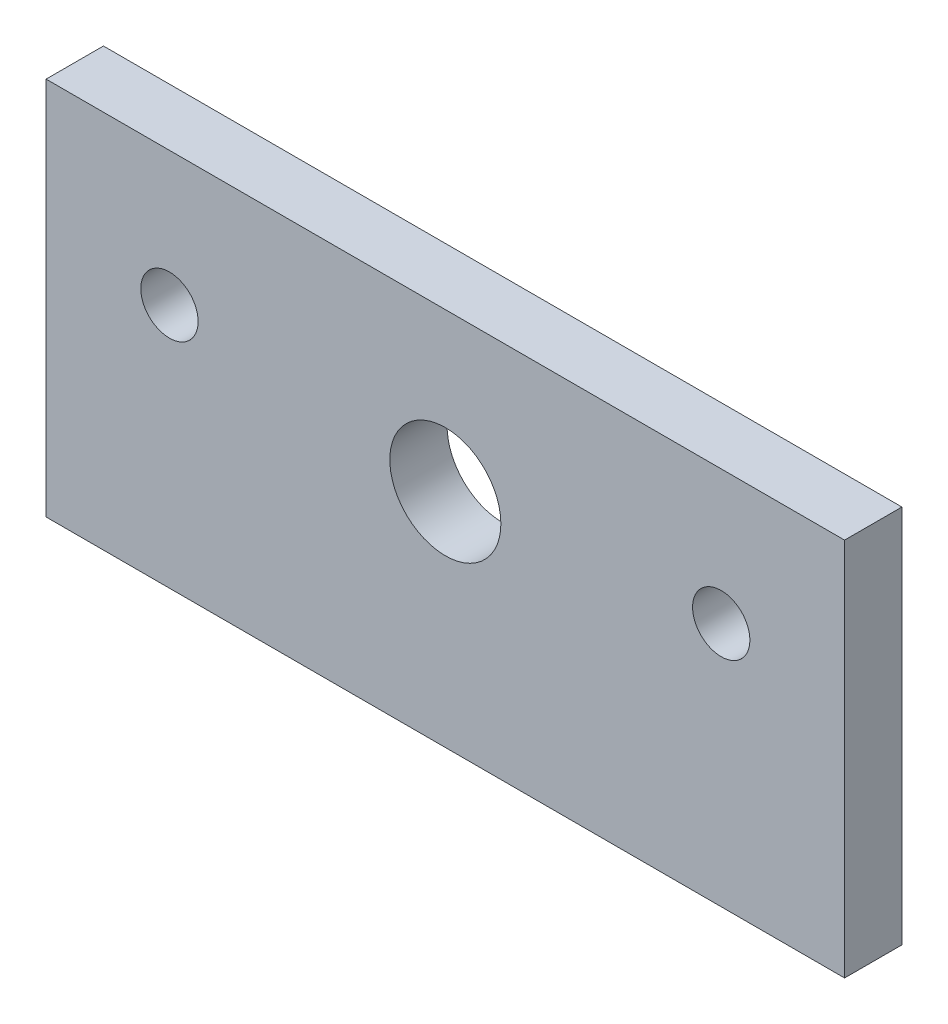
ISO-10303-21;
HEADER;
FILE_DESCRIPTION(('STEP AP214'),'2;1');
FILE_NAME('part.step','',(''),(''),'','','');
FILE_SCHEMA(('AUTOMOTIVE_DESIGN { 1 0 10303 214 1 1 1 1 }'));
ENDSEC;
DATA;
#1=APPLICATION_CONTEXT('core data for automotive mechanical design processes');
#2=APPLICATION_PROTOCOL_DEFINITION('international standard','automotive_design',2000,#1);
#3=PRODUCT_CONTEXT('',#1,'mechanical');
#4=PRODUCT('Part','Part','',(#3));
#5=PRODUCT_RELATED_PRODUCT_CATEGORY('part','',(#4));
#6=PRODUCT_DEFINITION_FORMATION('','',#4);
#7=PRODUCT_DEFINITION_CONTEXT('part definition',#1,'design');
#8=PRODUCT_DEFINITION('design','',#6,#7);
#9=PRODUCT_DEFINITION_SHAPE('','',#8);
#10=(LENGTH_UNIT() NAMED_UNIT(*) SI_UNIT(.MILLI.,.METRE.));
#11=(NAMED_UNIT(*) PLANE_ANGLE_UNIT() SI_UNIT($,.RADIAN.));
#12=(NAMED_UNIT(*) SI_UNIT($,.STERADIAN.) SOLID_ANGLE_UNIT());
#13=UNCERTAINTY_MEASURE_WITH_UNIT(LENGTH_MEASURE(1.E-05),#10,'distance_accuracy_value','');
#14=(GEOMETRIC_REPRESENTATION_CONTEXT(3) GLOBAL_UNCERTAINTY_ASSIGNED_CONTEXT((#13)) GLOBAL_UNIT_ASSIGNED_CONTEXT((#10,
#11,#12)) REPRESENTATION_CONTEXT('',''));
#15=CARTESIAN_POINT('',(0.,0.,0.));
#16=DIRECTION('',(0.,0.,1.));
#17=DIRECTION('',(1.,0.,0.));
#18=AXIS2_PLACEMENT_3D('',#15,#16,#17);
#19=CARTESIAN_POINT('',(-55.9295902988013,0.,8.));
#20=DIRECTION('',(-1.,0.,0.));
#21=DIRECTION('',(0.,0.,1.));
#22=AXIS2_PLACEMENT_3D('',#19,#20,#21);
#23=PLANE('',#22);
#24=DIRECTION('',(0.,1.,0.));
#25=VECTOR('',#24,1.);
#26=CARTESIAN_POINT('',(-55.9295902988013,0.,0.));
#27=LINE('',#26,#25);
#28=CARTESIAN_POINT('',(-55.9295902988013,-41.6378703415326,0.));
#29=VERTEX_POINT('',#28);
#30=CARTESIAN_POINT('',(-55.9295902988013,11.283196531097,0.));
#31=VERTEX_POINT('',#30);
#32=EDGE_CURVE('E131',#29,#31,#27,.T.);
#33=ORIENTED_EDGE('',*,*,#32,.F.);
#34=DIRECTION('',(0.,0.,-1.));
#35=VECTOR('',#34,1.);
#36=CARTESIAN_POINT('',(-55.9295902988013,-41.6378703415326,8.));
#37=LINE('',#36,#35);
#38=CARTESIAN_POINT('',(-55.9295902988013,-41.6378703415326,8.));
#39=VERTEX_POINT('',#38);
#40=EDGE_CURVE('E11',#39,#29,#37,.T.);
#41=ORIENTED_EDGE('',*,*,#40,.F.);
#42=DIRECTION('',(0.,1.,0.));
#43=VECTOR('',#42,1.);
#44=CARTESIAN_POINT('',(-55.9295902988013,0.,8.));
#45=LINE('',#44,#43);
#46=CARTESIAN_POINT('',(-55.9295902988013,11.283196531097,8.));
#47=VERTEX_POINT('',#46);
#48=EDGE_CURVE('E109',#39,#47,#45,.T.);
#49=ORIENTED_EDGE('',*,*,#48,.T.);
#50=DIRECTION('',(0.,0.,-1.));
#51=VECTOR('',#50,1.);
#52=CARTESIAN_POINT('',(-55.9295902988013,11.283196531097,8.));
#53=LINE('',#52,#51);
#54=EDGE_CURVE('E69',#47,#31,#53,.T.);
#55=ORIENTED_EDGE('',*,*,#54,.T.);
#56=EDGE_LOOP('',(#33,#41,#49,#55));
#57=FACE_BOUND('',#56,.T.);
#58=ADVANCED_FACE('F51',(#57),#23,.T.);
#59=CARTESIAN_POINT('',(0.,-41.6378703415326,8.));
#60=DIRECTION('',(0.,-1.,0.));
#61=DIRECTION('',(0.,0.,-1.));
#62=AXIS2_PLACEMENT_3D('',#59,#60,#61);
#63=PLANE('',#62);
#64=DIRECTION('',(-1.,0.,0.));
#65=VECTOR('',#64,1.);
#66=CARTESIAN_POINT('',(0.,-41.6378703415326,0.));
#67=LINE('',#66,#65);
#68=CARTESIAN_POINT('',(55.4962481395173,-41.6378703415326,0.));
#69=VERTEX_POINT('',#68);
#70=EDGE_CURVE('E99',#69,#29,#67,.T.);
#71=ORIENTED_EDGE('',*,*,#70,.F.);
#72=DIRECTION('',(0.,0.,-1.));
#73=VECTOR('',#72,1.);
#74=CARTESIAN_POINT('',(55.4962481395173,-41.6378703415326,8.));
#75=LINE('',#74,#73);
#76=CARTESIAN_POINT('',(55.4962481395173,-41.6378703415326,8.));
#77=VERTEX_POINT('',#76);
#78=EDGE_CURVE('E61',#77,#69,#75,.T.);
#79=ORIENTED_EDGE('',*,*,#78,.F.);
#80=DIRECTION('',(-1.,0.,0.));
#81=VECTOR('',#80,1.);
#82=CARTESIAN_POINT('',(0.,-41.6378703415326,8.));
#83=LINE('',#82,#81);
#84=EDGE_CURVE('E97',#77,#39,#83,.T.);
#85=ORIENTED_EDGE('',*,*,#84,.T.);
#86=ORIENTED_EDGE('',*,*,#40,.T.);
#87=EDGE_LOOP('',(#71,#79,#85,#86));
#88=FACE_BOUND('',#87,.T.);
#89=ADVANCED_FACE('F96',(#88),#63,.T.);
#90=CARTESIAN_POINT('',(55.4962481395173,0.,8.));
#91=DIRECTION('',(1.,0.,0.));
#92=DIRECTION('',(0.,0.,-1.));
#93=AXIS2_PLACEMENT_3D('',#90,#91,#92);
#94=PLANE('',#93);
#95=DIRECTION('',(0.,-1.,0.));
#96=VECTOR('',#95,1.);
#97=CARTESIAN_POINT('',(55.4962481395173,0.,0.));
#98=LINE('',#97,#96);
#99=CARTESIAN_POINT('',(55.4962481395173,11.283196531097,0.));
#100=VERTEX_POINT('',#99);
#101=EDGE_CURVE('E136',#100,#69,#98,.T.);
#102=ORIENTED_EDGE('',*,*,#101,.F.);
#103=DIRECTION('',(0.,0.,-1.));
#104=VECTOR('',#103,1.);
#105=CARTESIAN_POINT('',(55.4962481395173,11.283196531097,8.));
#106=LINE('',#105,#104);
#107=CARTESIAN_POINT('',(55.4962481395173,11.283196531097,8.));
#108=VERTEX_POINT('',#107);
#109=EDGE_CURVE('E82',#108,#100,#106,.T.);
#110=ORIENTED_EDGE('',*,*,#109,.F.);
#111=DIRECTION('',(0.,-1.,0.));
#112=VECTOR('',#111,1.);
#113=CARTESIAN_POINT('',(55.4962481395173,0.,8.));
#114=LINE('',#113,#112);
#115=EDGE_CURVE('E108',#108,#77,#114,.T.);
#116=ORIENTED_EDGE('',*,*,#115,.T.);
#117=ORIENTED_EDGE('',*,*,#78,.T.);
#118=EDGE_LOOP('',(#102,#110,#116,#117));
#119=FACE_BOUND('',#118,.T.);
#120=ADVANCED_FACE('F112',(#119),#94,.T.);
#121=CARTESIAN_POINT('',(38.2833289203579,-7.41680346890308,8.));
#122=DIRECTION('',(0.,0.,-1.));
#123=DIRECTION('',(-1.,0.,0.));
#124=AXIS2_PLACEMENT_3D('',#121,#122,#123);
#125=CYLINDRICAL_SURFACE('',#124,4.00000000000001);
#126=CARTESIAN_POINT('',(38.2833289203579,-7.41680346890308,8.));
#127=DIRECTION('',(0.,0.,1.));
#128=DIRECTION('',(1.,0.,0.));
#129=AXIS2_PLACEMENT_3D('',#126,#127,#128);
#130=CIRCLE('',#129,4.00000000000001);
#131=CARTESIAN_POINT('',(42.283328920358,-7.41680346890308,8.));
#132=VERTEX_POINT('',#131);
#133=EDGE_CURVE('E160',#132,#132,#130,.T.);
#134=ORIENTED_EDGE('',*,*,#133,.T.);
#135=EDGE_LOOP('',(#134));
#136=FACE_BOUND('',#135,.T.);
#137=CARTESIAN_POINT('',(38.2833289203579,-7.41680346890308,0.));
#138=DIRECTION('',(0.,0.,1.));
#139=DIRECTION('',(1.,0.,0.));
#140=AXIS2_PLACEMENT_3D('',#137,#138,#139);
#141=CIRCLE('',#140,4.00000000000001);
#142=CARTESIAN_POINT('',(42.283328920358,-7.41680346890308,0.));
#143=VERTEX_POINT('',#142);
#144=EDGE_CURVE('E126',#143,#143,#141,.T.);
#145=ORIENTED_EDGE('',*,*,#144,.F.);
#146=EDGE_LOOP('',(#145));
#147=FACE_BOUND('',#146,.T.);
#148=ADVANCED_FACE('F207',(#136,#147),#125,.F.);
#149=CARTESIAN_POINT('',(-38.716671079642,-7.41680346890299,8.));
#150=DIRECTION('',(0.,0.,-1.));
#151=DIRECTION('',(-1.,0.,0.));
#152=AXIS2_PLACEMENT_3D('',#149,#150,#151);
#153=CYLINDRICAL_SURFACE('',#152,4.);
#154=CARTESIAN_POINT('',(-38.716671079642,-7.41680346890299,8.));
#155=DIRECTION('',(0.,0.,1.));
#156=DIRECTION('',(1.,0.,0.));
#157=AXIS2_PLACEMENT_3D('',#154,#155,#156);
#158=CIRCLE('',#157,4.);
#159=CARTESIAN_POINT('',(-34.716671079642,-7.41680346890299,8.));
#160=VERTEX_POINT('',#159);
#161=EDGE_CURVE('E143',#160,#160,#158,.T.);
#162=ORIENTED_EDGE('',*,*,#161,.T.);
#163=EDGE_LOOP('',(#162));
#164=FACE_BOUND('',#163,.T.);
#165=CARTESIAN_POINT('',(-38.716671079642,-7.41680346890299,0.));
#166=DIRECTION('',(0.,0.,1.));
#167=DIRECTION('',(1.,0.,0.));
#168=AXIS2_PLACEMENT_3D('',#165,#166,#167);
#169=CIRCLE('',#168,4.);
#170=CARTESIAN_POINT('',(-34.716671079642,-7.41680346890299,0.));
#171=VERTEX_POINT('',#170);
#172=EDGE_CURVE('E122',#171,#171,#169,.T.);
#173=ORIENTED_EDGE('',*,*,#172,.F.);
#174=EDGE_LOOP('',(#173));
#175=FACE_BOUND('',#174,.T.);
#176=ADVANCED_FACE('F53',(#164,#175),#153,.F.);
#177=CARTESIAN_POINT('',(0.,11.283196531097,8.));
#178=DIRECTION('',(0.,1.,0.));
#179=DIRECTION('',(0.,0.,1.));
#180=AXIS2_PLACEMENT_3D('',#177,#178,#179);
#181=PLANE('',#180);
#182=DIRECTION('',(1.,0.,0.));
#183=VECTOR('',#182,1.);
#184=CARTESIAN_POINT('',(0.,11.283196531097,0.));
#185=LINE('',#184,#183);
#186=EDGE_CURVE('E139',#31,#100,#185,.T.);
#187=ORIENTED_EDGE('',*,*,#186,.F.);
#188=ORIENTED_EDGE('',*,*,#54,.F.);
#189=DIRECTION('',(1.,0.,0.));
#190=VECTOR('',#189,1.);
#191=CARTESIAN_POINT('',(0.,11.283196531097,8.));
#192=LINE('',#191,#190);
#193=EDGE_CURVE('E114',#47,#108,#192,.T.);
#194=ORIENTED_EDGE('',*,*,#193,.T.);
#195=ORIENTED_EDGE('',*,*,#109,.T.);
#196=EDGE_LOOP('',(#187,#188,#194,#195));
#197=FACE_BOUND('',#196,.T.);
#198=ADVANCED_FACE('F201',(#197),#181,.T.);
#199=CARTESIAN_POINT('',(0.,0.,8.));
#200=DIRECTION('',(0.,0.,1.));
#201=DIRECTION('',(1.,0.,0.));
#202=AXIS2_PLACEMENT_3D('',#199,#200,#201);
#203=PLANE('',#202);
#204=CARTESIAN_POINT('',(-0.216671079642593,-10.716803468903,8.));
#205=DIRECTION('',(0.,0.,1.));
#206=DIRECTION('',(1.,0.,0.));
#207=AXIS2_PLACEMENT_3D('',#204,#205,#206);
#208=CIRCLE('',#207,7.75);
#209=CARTESIAN_POINT('',(7.53332892035741,-10.716803468903,8.));
#210=VERTEX_POINT('',#209);
#211=EDGE_CURVE('E187',#210,#210,#208,.T.);
#212=ORIENTED_EDGE('',*,*,#211,.F.);
#213=EDGE_LOOP('',(#212));
#214=FACE_BOUND('',#213,.T.);
#215=ORIENTED_EDGE('',*,*,#161,.F.);
#216=EDGE_LOOP('',(#215));
#217=FACE_BOUND('',#216,.T.);
#218=ORIENTED_EDGE('',*,*,#133,.F.);
#219=EDGE_LOOP('',(#218));
#220=FACE_BOUND('',#219,.T.);
#221=ORIENTED_EDGE('',*,*,#48,.F.);
#222=ORIENTED_EDGE('',*,*,#84,.F.);
#223=ORIENTED_EDGE('',*,*,#115,.F.);
#224=ORIENTED_EDGE('',*,*,#193,.F.);
#225=EDGE_LOOP('',(#221,#222,#223,#224));
#226=FACE_BOUND('',#225,.T.);
#227=ADVANCED_FACE('F106',(#214,#217,#220,#226),#203,.T.);
#228=CARTESIAN_POINT('',(0.,0.,0.));
#229=DIRECTION('',(0.,0.,1.));
#230=DIRECTION('',(1.,0.,0.));
#231=AXIS2_PLACEMENT_3D('',#228,#229,#230);
#232=PLANE('',#231);
#233=CARTESIAN_POINT('',(-0.216671079642593,-10.716803468903,0.));
#234=DIRECTION('',(0.,0.,1.));
#235=DIRECTION('',(1.,0.,0.));
#236=AXIS2_PLACEMENT_3D('',#233,#234,#235);
#237=CIRCLE('',#236,7.75);
#238=CARTESIAN_POINT('',(7.53332892035741,-10.716803468903,0.));
#239=VERTEX_POINT('',#238);
#240=EDGE_CURVE('E127',#239,#239,#237,.T.);
#241=ORIENTED_EDGE('',*,*,#240,.T.);
#242=EDGE_LOOP('',(#241));
#243=FACE_BOUND('',#242,.T.);
#244=ORIENTED_EDGE('',*,*,#172,.T.);
#245=EDGE_LOOP('',(#244));
#246=FACE_BOUND('',#245,.T.);
#247=ORIENTED_EDGE('',*,*,#144,.T.);
#248=EDGE_LOOP('',(#247));
#249=FACE_BOUND('',#248,.T.);
#250=ORIENTED_EDGE('',*,*,#32,.T.);
#251=ORIENTED_EDGE('',*,*,#186,.T.);
#252=ORIENTED_EDGE('',*,*,#101,.T.);
#253=ORIENTED_EDGE('',*,*,#70,.T.);
#254=EDGE_LOOP('',(#250,#251,#252,#253));
#255=FACE_BOUND('',#254,.T.);
#256=ADVANCED_FACE('F200',(#243,#246,#249,#255),#232,.F.);
#257=CARTESIAN_POINT('',(-0.216671079642593,-10.716803468903,0.));
#258=DIRECTION('',(0.,0.,1.));
#259=DIRECTION('',(1.,0.,0.));
#260=AXIS2_PLACEMENT_3D('',#257,#258,#259);
#261=CYLINDRICAL_SURFACE('',#260,7.75);
#262=ORIENTED_EDGE('',*,*,#240,.F.);
#263=EDGE_LOOP('',(#262));
#264=FACE_BOUND('',#263,.T.);
#265=ORIENTED_EDGE('',*,*,#211,.T.);
#266=EDGE_LOOP('',(#265));
#267=FACE_BOUND('',#266,.T.);
#268=ADVANCED_FACE('F196',(#264,#267),#261,.F.);
#269=CLOSED_SHELL('',(#58,#89,#120,#148,#176,#198,#227,#256,#268));
#270=MANIFOLD_SOLID_BREP('B2',#269);
#271=ADVANCED_BREP_SHAPE_REPRESENTATION('',(#18,#270),#14);
#272=SHAPE_DEFINITION_REPRESENTATION(#9,#271);
ENDSEC;
END-ISO-10303-21;
